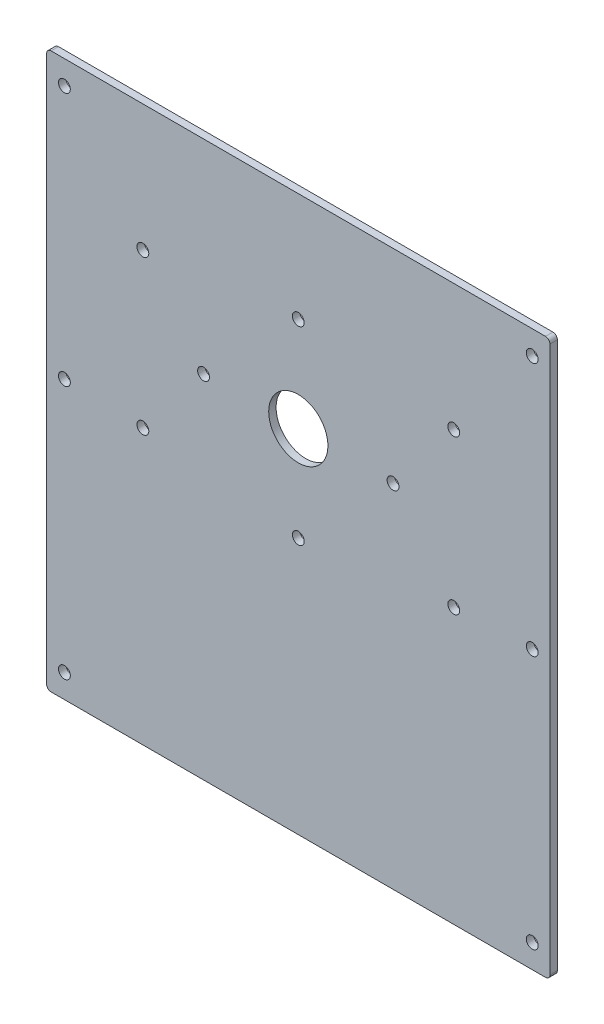
ISO-10303-21;
HEADER;
FILE_DESCRIPTION(('STEP AP214'),'2;1');
FILE_NAME('part.step','',(''),(''),'','','');
FILE_SCHEMA(('AUTOMOTIVE_DESIGN { 1 0 10303 214 1 1 1 1 }'));
ENDSEC;
DATA;
#1=APPLICATION_CONTEXT('core data for automotive mechanical design processes');
#2=APPLICATION_PROTOCOL_DEFINITION('international standard','automotive_design',2000,#1);
#3=PRODUCT_CONTEXT('',#1,'mechanical');
#4=PRODUCT('Part','Part','',(#3));
#5=PRODUCT_RELATED_PRODUCT_CATEGORY('part','',(#4));
#6=PRODUCT_DEFINITION_FORMATION('','',#4);
#7=PRODUCT_DEFINITION_CONTEXT('part definition',#1,'design');
#8=PRODUCT_DEFINITION('design','',#6,#7);
#9=PRODUCT_DEFINITION_SHAPE('','',#8);
#10=(LENGTH_UNIT() NAMED_UNIT(*) SI_UNIT(.MILLI.,.METRE.));
#11=(NAMED_UNIT(*) PLANE_ANGLE_UNIT() SI_UNIT($,.RADIAN.));
#12=(NAMED_UNIT(*) SI_UNIT($,.STERADIAN.) SOLID_ANGLE_UNIT());
#13=UNCERTAINTY_MEASURE_WITH_UNIT(LENGTH_MEASURE(1.E-05),#10,'distance_accuracy_value','');
#14=(GEOMETRIC_REPRESENTATION_CONTEXT(3) GLOBAL_UNCERTAINTY_ASSIGNED_CONTEXT((#13)) GLOBAL_UNIT_ASSIGNED_CONTEXT((#10,
#11,#12)) REPRESENTATION_CONTEXT('',''));
#15=CARTESIAN_POINT('',(0.,0.,0.));
#16=DIRECTION('',(0.,0.,1.));
#17=DIRECTION('',(1.,0.,0.));
#18=AXIS2_PLACEMENT_3D('',#15,#16,#17);
#19=CARTESIAN_POINT('',(-167.,184.5,0.));
#20=DIRECTION('',(0.,0.,1.));
#21=DIRECTION('',(1.,0.,0.));
#22=AXIS2_PLACEMENT_3D('',#19,#20,#21);
#23=CYLINDRICAL_SURFACE('',#22,3.);
#24=CARTESIAN_POINT('',(-167.,184.5,5.));
#25=DIRECTION('',(0.,0.,1.));
#26=DIRECTION('',(1.,0.,0.));
#27=AXIS2_PLACEMENT_3D('',#24,#25,#26);
#28=CIRCLE('',#27,3.);
#29=CARTESIAN_POINT('',(-167.,187.5,5.));
#30=VERTEX_POINT('',#29);
#31=CARTESIAN_POINT('',(-170.,184.5,5.));
#32=VERTEX_POINT('',#31);
#33=EDGE_CURVE('E130',#30,#32,#28,.T.);
#34=ORIENTED_EDGE('',*,*,#33,.F.);
#35=DIRECTION('',(0.,0.,1.));
#36=VECTOR('',#35,1.);
#37=CARTESIAN_POINT('',(-167.,187.5,0.));
#38=LINE('',#37,#36);
#39=CARTESIAN_POINT('',(-167.,187.5,0.));
#40=VERTEX_POINT('',#39);
#41=EDGE_CURVE('E11',#40,#30,#38,.T.);
#42=ORIENTED_EDGE('',*,*,#41,.F.);
#43=CARTESIAN_POINT('',(-167.,184.5,0.));
#44=DIRECTION('',(0.,0.,1.));
#45=DIRECTION('',(1.,0.,0.));
#46=AXIS2_PLACEMENT_3D('',#43,#44,#45);
#47=CIRCLE('',#46,3.);
#48=CARTESIAN_POINT('',(-170.,184.5,0.));
#49=VERTEX_POINT('',#48);
#50=EDGE_CURVE('E151',#40,#49,#47,.T.);
#51=ORIENTED_EDGE('',*,*,#50,.T.);
#52=DIRECTION('',(0.,0.,1.));
#53=VECTOR('',#52,1.);
#54=CARTESIAN_POINT('',(-170.,184.5,0.));
#55=LINE('',#54,#53);
#56=EDGE_CURVE('E36',#49,#32,#55,.T.);
#57=ORIENTED_EDGE('',*,*,#56,.T.);
#58=EDGE_LOOP('',(#34,#42,#51,#57));
#59=FACE_BOUND('',#58,.T.);
#60=ADVANCED_FACE('F33',(#59),#23,.T.);
#61=CARTESIAN_POINT('',(167.,187.5,0.));
#62=DIRECTION('',(0.,1.,0.));
#63=DIRECTION('',(-1.,0.,0.));
#64=AXIS2_PLACEMENT_3D('',#61,#62,#63);
#65=PLANE('',#64);
#66=DIRECTION('',(-1.,0.,0.));
#67=VECTOR('',#66,1.);
#68=CARTESIAN_POINT('',(167.,187.5,5.));
#69=LINE('',#68,#67);
#70=CARTESIAN_POINT('',(167.,187.5,5.));
#71=VERTEX_POINT('',#70);
#72=EDGE_CURVE('E149',#71,#30,#69,.T.);
#73=ORIENTED_EDGE('',*,*,#72,.F.);
#74=DIRECTION('',(0.,0.,1.));
#75=VECTOR('',#74,1.);
#76=CARTESIAN_POINT('',(167.,187.5,0.));
#77=LINE('',#76,#75);
#78=CARTESIAN_POINT('',(167.,187.5,0.));
#79=VERTEX_POINT('',#78);
#80=EDGE_CURVE('E42',#79,#71,#77,.T.);
#81=ORIENTED_EDGE('',*,*,#80,.F.);
#82=DIRECTION('',(-1.,0.,0.));
#83=VECTOR('',#82,1.);
#84=CARTESIAN_POINT('',(167.,187.5,0.));
#85=LINE('',#84,#83);
#86=EDGE_CURVE('E120',#79,#40,#85,.T.);
#87=ORIENTED_EDGE('',*,*,#86,.T.);
#88=ORIENTED_EDGE('',*,*,#41,.T.);
#89=EDGE_LOOP('',(#73,#81,#87,#88));
#90=FACE_BOUND('',#89,.T.);
#91=ADVANCED_FACE('F163',(#90),#65,.T.);
#92=CARTESIAN_POINT('',(167.,184.5,0.));
#93=DIRECTION('',(0.,0.,1.));
#94=DIRECTION('',(1.,0.,0.));
#95=AXIS2_PLACEMENT_3D('',#92,#93,#94);
#96=CYLINDRICAL_SURFACE('',#95,3.00000000000004);
#97=CARTESIAN_POINT('',(167.,184.5,5.));
#98=DIRECTION('',(0.,0.,1.));
#99=DIRECTION('',(1.,0.,0.));
#100=AXIS2_PLACEMENT_3D('',#97,#98,#99);
#101=CIRCLE('',#100,3.00000000000004);
#102=CARTESIAN_POINT('',(170.,184.5,5.));
#103=VERTEX_POINT('',#102);
#104=EDGE_CURVE('E107',#103,#71,#101,.T.);
#105=ORIENTED_EDGE('',*,*,#104,.F.);
#106=DIRECTION('',(0.,0.,1.));
#107=VECTOR('',#106,1.);
#108=CARTESIAN_POINT('',(170.,184.5,0.));
#109=LINE('',#108,#107);
#110=CARTESIAN_POINT('',(170.,184.5,0.));
#111=VERTEX_POINT('',#110);
#112=EDGE_CURVE('E102',#111,#103,#109,.T.);
#113=ORIENTED_EDGE('',*,*,#112,.F.);
#114=CARTESIAN_POINT('',(167.,184.5,0.));
#115=DIRECTION('',(0.,0.,1.));
#116=DIRECTION('',(1.,0.,0.));
#117=AXIS2_PLACEMENT_3D('',#114,#115,#116);
#118=CIRCLE('',#117,3.00000000000004);
#119=EDGE_CURVE('E105',#111,#79,#118,.T.);
#120=ORIENTED_EDGE('',*,*,#119,.T.);
#121=ORIENTED_EDGE('',*,*,#80,.T.);
#122=EDGE_LOOP('',(#105,#113,#120,#121));
#123=FACE_BOUND('',#122,.T.);
#124=ADVANCED_FACE('F104',(#123),#96,.T.);
#125=CARTESIAN_POINT('',(170.,-184.5,0.));
#126=DIRECTION('',(1.,0.,0.));
#127=DIRECTION('',(0.,0.,-1.));
#128=AXIS2_PLACEMENT_3D('',#125,#126,#127);
#129=PLANE('',#128);
#130=DIRECTION('',(0.,1.,0.));
#131=VECTOR('',#130,1.);
#132=CARTESIAN_POINT('',(170.,-184.5,5.));
#133=LINE('',#132,#131);
#134=CARTESIAN_POINT('',(170.,-184.5,5.));
#135=VERTEX_POINT('',#134);
#136=EDGE_CURVE('E146',#135,#103,#133,.T.);
#137=ORIENTED_EDGE('',*,*,#136,.F.);
#138=DIRECTION('',(0.,0.,1.));
#139=VECTOR('',#138,1.);
#140=CARTESIAN_POINT('',(170.,-184.5,0.));
#141=LINE('',#140,#139);
#142=CARTESIAN_POINT('',(170.,-184.5,0.));
#143=VERTEX_POINT('',#142);
#144=EDGE_CURVE('E112',#143,#135,#141,.T.);
#145=ORIENTED_EDGE('',*,*,#144,.F.);
#146=DIRECTION('',(0.,1.,0.));
#147=VECTOR('',#146,1.);
#148=CARTESIAN_POINT('',(170.,-184.5,0.));
#149=LINE('',#148,#147);
#150=EDGE_CURVE('E118',#143,#111,#149,.T.);
#151=ORIENTED_EDGE('',*,*,#150,.T.);
#152=ORIENTED_EDGE('',*,*,#112,.T.);
#153=EDGE_LOOP('',(#137,#145,#151,#152));
#154=FACE_BOUND('',#153,.T.);
#155=ADVANCED_FACE('F122',(#154),#129,.T.);
#156=CARTESIAN_POINT('',(167.,-184.5,0.));
#157=DIRECTION('',(0.,0.,1.));
#158=DIRECTION('',(1.,0.,0.));
#159=AXIS2_PLACEMENT_3D('',#156,#157,#158);
#160=CYLINDRICAL_SURFACE('',#159,3.00000000000002);
#161=CARTESIAN_POINT('',(167.,-184.5,5.));
#162=DIRECTION('',(0.,0.,1.));
#163=DIRECTION('',(1.,0.,0.));
#164=AXIS2_PLACEMENT_3D('',#161,#162,#163);
#165=CIRCLE('',#164,3.00000000000002);
#166=CARTESIAN_POINT('',(167.,-187.5,5.));
#167=VERTEX_POINT('',#166);
#168=EDGE_CURVE('E143',#167,#135,#165,.T.);
#169=ORIENTED_EDGE('',*,*,#168,.F.);
#170=DIRECTION('',(0.,0.,1.));
#171=VECTOR('',#170,1.);
#172=CARTESIAN_POINT('',(167.,-187.5,0.));
#173=LINE('',#172,#171);
#174=CARTESIAN_POINT('',(167.,-187.5,0.));
#175=VERTEX_POINT('',#174);
#176=EDGE_CURVE('E155',#175,#167,#173,.T.);
#177=ORIENTED_EDGE('',*,*,#176,.F.);
#178=CARTESIAN_POINT('',(167.,-184.5,0.));
#179=DIRECTION('',(0.,0.,1.));
#180=DIRECTION('',(1.,0.,0.));
#181=AXIS2_PLACEMENT_3D('',#178,#179,#180);
#182=CIRCLE('',#181,3.00000000000002);
#183=EDGE_CURVE('E123',#175,#143,#182,.T.);
#184=ORIENTED_EDGE('',*,*,#183,.T.);
#185=ORIENTED_EDGE('',*,*,#144,.T.);
#186=EDGE_LOOP('',(#169,#177,#184,#185));
#187=FACE_BOUND('',#186,.T.);
#188=ADVANCED_FACE('F176',(#187),#160,.T.);
#189=CARTESIAN_POINT('',(-167.,-187.5,0.));
#190=DIRECTION('',(0.,-1.,0.));
#191=DIRECTION('',(0.,0.,-1.));
#192=AXIS2_PLACEMENT_3D('',#189,#190,#191);
#193=PLANE('',#192);
#194=DIRECTION('',(1.,0.,0.));
#195=VECTOR('',#194,1.);
#196=CARTESIAN_POINT('',(-167.,-187.5,5.));
#197=LINE('',#196,#195);
#198=CARTESIAN_POINT('',(-167.,-187.5,5.));
#199=VERTEX_POINT('',#198);
#200=EDGE_CURVE('E140',#199,#167,#197,.T.);
#201=ORIENTED_EDGE('',*,*,#200,.F.);
#202=DIRECTION('',(0.,0.,1.));
#203=VECTOR('',#202,1.);
#204=CARTESIAN_POINT('',(-167.,-187.5,0.));
#205=LINE('',#204,#203);
#206=CARTESIAN_POINT('',(-167.,-187.5,0.));
#207=VERTEX_POINT('',#206);
#208=EDGE_CURVE('E157',#207,#199,#205,.T.);
#209=ORIENTED_EDGE('',*,*,#208,.F.);
#210=DIRECTION('',(1.,0.,0.));
#211=VECTOR('',#210,1.);
#212=CARTESIAN_POINT('',(-167.,-187.5,0.));
#213=LINE('',#212,#211);
#214=EDGE_CURVE('E125',#207,#175,#213,.T.);
#215=ORIENTED_EDGE('',*,*,#214,.T.);
#216=ORIENTED_EDGE('',*,*,#176,.T.);
#217=EDGE_LOOP('',(#201,#209,#215,#216));
#218=FACE_BOUND('',#217,.T.);
#219=ADVANCED_FACE('F179',(#218),#193,.T.);
#220=CARTESIAN_POINT('',(-167.,-184.5,0.));
#221=DIRECTION('',(0.,0.,1.));
#222=DIRECTION('',(1.,0.,0.));
#223=AXIS2_PLACEMENT_3D('',#220,#221,#222);
#224=CYLINDRICAL_SURFACE('',#223,2.99999999999998);
#225=CARTESIAN_POINT('',(-167.,-184.5,5.));
#226=DIRECTION('',(0.,0.,1.));
#227=DIRECTION('',(1.,0.,0.));
#228=AXIS2_PLACEMENT_3D('',#225,#226,#227);
#229=CIRCLE('',#228,2.99999999999998);
#230=CARTESIAN_POINT('',(-170.,-184.5,5.));
#231=VERTEX_POINT('',#230);
#232=EDGE_CURVE('E137',#231,#199,#229,.T.);
#233=ORIENTED_EDGE('',*,*,#232,.F.);
#234=DIRECTION('',(0.,0.,1.));
#235=VECTOR('',#234,1.);
#236=CARTESIAN_POINT('',(-170.,-184.5,0.));
#237=LINE('',#236,#235);
#238=CARTESIAN_POINT('',(-170.,-184.5,0.));
#239=VERTEX_POINT('',#238);
#240=EDGE_CURVE('E158',#239,#231,#237,.T.);
#241=ORIENTED_EDGE('',*,*,#240,.F.);
#242=CARTESIAN_POINT('',(-167.,-184.5,0.));
#243=DIRECTION('',(0.,0.,1.));
#244=DIRECTION('',(1.,0.,0.));
#245=AXIS2_PLACEMENT_3D('',#242,#243,#244);
#246=CIRCLE('',#245,2.99999999999998);
#247=EDGE_CURVE('E355',#239,#207,#246,.T.);
#248=ORIENTED_EDGE('',*,*,#247,.T.);
#249=ORIENTED_EDGE('',*,*,#208,.T.);
#250=EDGE_LOOP('',(#233,#241,#248,#249));
#251=FACE_BOUND('',#250,.T.);
#252=ADVANCED_FACE('F183',(#251),#224,.T.);
#253=CARTESIAN_POINT('',(-170.,184.5,0.));
#254=DIRECTION('',(-1.,0.,0.));
#255=DIRECTION('',(0.,-1.,0.));
#256=AXIS2_PLACEMENT_3D('',#253,#254,#255);
#257=PLANE('',#256);
#258=DIRECTION('',(0.,-1.,0.));
#259=VECTOR('',#258,1.);
#260=CARTESIAN_POINT('',(-170.,184.5,5.));
#261=LINE('',#260,#259);
#262=EDGE_CURVE('E133',#32,#231,#261,.T.);
#263=ORIENTED_EDGE('',*,*,#262,.F.);
#264=ORIENTED_EDGE('',*,*,#56,.F.);
#265=DIRECTION('',(0.,-1.,0.));
#266=VECTOR('',#265,1.);
#267=CARTESIAN_POINT('',(-170.,184.5,0.));
#268=LINE('',#267,#266);
#269=EDGE_CURVE('E353',#49,#239,#268,.T.);
#270=ORIENTED_EDGE('',*,*,#269,.T.);
#271=ORIENTED_EDGE('',*,*,#240,.T.);
#272=EDGE_LOOP('',(#263,#264,#270,#271));
#273=FACE_BOUND('',#272,.T.);
#274=ADVANCED_FACE('F160',(#273),#257,.T.);
#275=CARTESIAN_POINT('',(-167.,184.5,0.));
#276=DIRECTION('',(0.,0.,1.));
#277=DIRECTION('',(1.,0.,0.));
#278=AXIS2_PLACEMENT_3D('',#275,#276,#277);
#279=PLANE('',#278);
#280=CARTESIAN_POINT('',(105.,-1.99999999999998,0.));
#281=DIRECTION('',(0.,0.,1.));
#282=DIRECTION('',(-1.,0.,0.));
#283=AXIS2_PLACEMENT_3D('',#280,#281,#282);
#284=CIRCLE('',#283,4.00000000000001);
#285=CARTESIAN_POINT('',(101.,-1.99999999999998,0.));
#286=VERTEX_POINT('',#285);
#287=EDGE_CURVE('E262',#286,#286,#284,.T.);
#288=ORIENTED_EDGE('',*,*,#287,.T.);
#289=EDGE_LOOP('',(#288));
#290=FACE_BOUND('',#289,.T.);
#291=CARTESIAN_POINT('',(105.,102.,0.));
#292=DIRECTION('',(0.,0.,1.));
#293=DIRECTION('',(-1.,0.,0.));
#294=AXIS2_PLACEMENT_3D('',#291,#292,#293);
#295=CIRCLE('',#294,4.00000000000001);
#296=CARTESIAN_POINT('',(101.,102.,0.));
#297=VERTEX_POINT('',#296);
#298=EDGE_CURVE('E270',#297,#297,#295,.T.);
#299=ORIENTED_EDGE('',*,*,#298,.T.);
#300=EDGE_LOOP('',(#299));
#301=FACE_BOUND('',#300,.T.);
#302=CARTESIAN_POINT('',(-105.,-1.99999999999998,0.));
#303=DIRECTION('',(0.,0.,1.));
#304=DIRECTION('',(-1.,0.,0.));
#305=AXIS2_PLACEMENT_3D('',#302,#303,#304);
#306=CIRCLE('',#305,4.00000000000001);
#307=CARTESIAN_POINT('',(-109.,-1.99999999999998,0.));
#308=VERTEX_POINT('',#307);
#309=EDGE_CURVE('E276',#308,#308,#306,.T.);
#310=ORIENTED_EDGE('',*,*,#309,.T.);
#311=EDGE_LOOP('',(#310));
#312=FACE_BOUND('',#311,.T.);
#313=CARTESIAN_POINT('',(-105.,102.,0.));
#314=DIRECTION('',(0.,0.,1.));
#315=DIRECTION('',(-1.,0.,0.));
#316=AXIS2_PLACEMENT_3D('',#313,#314,#315);
#317=CIRCLE('',#316,4.00000000000001);
#318=CARTESIAN_POINT('',(-109.,102.,0.));
#319=VERTEX_POINT('',#318);
#320=EDGE_CURVE('E282',#319,#319,#317,.T.);
#321=ORIENTED_EDGE('',*,*,#320,.T.);
#322=EDGE_LOOP('',(#321));
#323=FACE_BOUND('',#322,.T.);
#324=CARTESIAN_POINT('',(158.,-171.5,0.));
#325=DIRECTION('',(0.,0.,1.));
#326=DIRECTION('',(-1.,0.,0.));
#327=AXIS2_PLACEMENT_3D('',#324,#325,#326);
#328=CIRCLE('',#327,3.99999999999999);
#329=CARTESIAN_POINT('',(154.,-171.5,0.));
#330=VERTEX_POINT('',#329);
#331=EDGE_CURVE('E288',#330,#330,#328,.T.);
#332=ORIENTED_EDGE('',*,*,#331,.T.);
#333=EDGE_LOOP('',(#332));
#334=FACE_BOUND('',#333,.T.);
#335=CARTESIAN_POINT('',(-158.,-171.5,0.));
#336=DIRECTION('',(0.,0.,1.));
#337=DIRECTION('',(-1.,0.,0.));
#338=AXIS2_PLACEMENT_3D('',#335,#336,#337);
#339=CIRCLE('',#338,3.99999999999999);
#340=CARTESIAN_POINT('',(-162.,-171.5,0.));
#341=VERTEX_POINT('',#340);
#342=EDGE_CURVE('E294',#341,#341,#339,.T.);
#343=ORIENTED_EDGE('',*,*,#342,.T.);
#344=EDGE_LOOP('',(#343));
#345=FACE_BOUND('',#344,.T.);
#346=CARTESIAN_POINT('',(-158.,171.5,0.));
#347=DIRECTION('',(0.,0.,1.));
#348=DIRECTION('',(-1.,0.,0.));
#349=AXIS2_PLACEMENT_3D('',#346,#347,#348);
#350=CIRCLE('',#349,3.99999999999999);
#351=CARTESIAN_POINT('',(-162.,171.5,0.));
#352=VERTEX_POINT('',#351);
#353=EDGE_CURVE('E300',#352,#352,#350,.T.);
#354=ORIENTED_EDGE('',*,*,#353,.T.);
#355=EDGE_LOOP('',(#354));
#356=FACE_BOUND('',#355,.T.);
#357=CARTESIAN_POINT('',(158.,171.5,0.));
#358=DIRECTION('',(0.,0.,1.));
#359=DIRECTION('',(-1.,0.,0.));
#360=AXIS2_PLACEMENT_3D('',#357,#358,#359);
#361=CIRCLE('',#360,3.99999999999999);
#362=CARTESIAN_POINT('',(154.,171.5,0.));
#363=VERTEX_POINT('',#362);
#364=EDGE_CURVE('E306',#363,#363,#361,.T.);
#365=ORIENTED_EDGE('',*,*,#364,.T.);
#366=EDGE_LOOP('',(#365));
#367=FACE_BOUND('',#366,.T.);
#368=CARTESIAN_POINT('',(-158.,0.,0.));
#369=DIRECTION('',(0.,0.,1.));
#370=DIRECTION('',(-1.,0.,0.));
#371=AXIS2_PLACEMENT_3D('',#368,#369,#370);
#372=CIRCLE('',#371,3.99999999999999);
#373=CARTESIAN_POINT('',(-162.,0.,0.));
#374=VERTEX_POINT('',#373);
#375=EDGE_CURVE('E312',#374,#374,#372,.T.);
#376=ORIENTED_EDGE('',*,*,#375,.T.);
#377=EDGE_LOOP('',(#376));
#378=FACE_BOUND('',#377,.T.);
#379=CARTESIAN_POINT('',(158.,0.,0.));
#380=DIRECTION('',(0.,0.,1.));
#381=DIRECTION('',(-1.,0.,0.));
#382=AXIS2_PLACEMENT_3D('',#379,#380,#381);
#383=CIRCLE('',#382,3.99999999999999);
#384=CARTESIAN_POINT('',(154.,0.,0.));
#385=VERTEX_POINT('',#384);
#386=EDGE_CURVE('E318',#385,#385,#383,.T.);
#387=ORIENTED_EDGE('',*,*,#386,.T.);
#388=EDGE_LOOP('',(#387));
#389=FACE_BOUND('',#388,.T.);
#390=CARTESIAN_POINT('',(0.,-14.,0.));
#391=DIRECTION('',(0.,0.,1.));
#392=DIRECTION('',(-1.,0.,0.));
#393=AXIS2_PLACEMENT_3D('',#390,#391,#392);
#394=CIRCLE('',#393,4.);
#395=CARTESIAN_POINT('',(-3.99999999999999,-14.,0.));
#396=VERTEX_POINT('',#395);
#397=EDGE_CURVE('E324',#396,#396,#394,.T.);
#398=ORIENTED_EDGE('',*,*,#397,.T.);
#399=EDGE_LOOP('',(#398));
#400=FACE_BOUND('',#399,.T.);
#401=CARTESIAN_POINT('',(64.,50.,0.));
#402=DIRECTION('',(0.,0.,1.));
#403=DIRECTION('',(-1.,0.,0.));
#404=AXIS2_PLACEMENT_3D('',#401,#402,#403);
#405=CIRCLE('',#404,4.00000000000001);
#406=CARTESIAN_POINT('',(60.,50.,0.));
#407=VERTEX_POINT('',#406);
#408=EDGE_CURVE('E330',#407,#407,#405,.T.);
#409=ORIENTED_EDGE('',*,*,#408,.T.);
#410=EDGE_LOOP('',(#409));
#411=FACE_BOUND('',#410,.T.);
#412=CARTESIAN_POINT('',(0.,114.,0.));
#413=DIRECTION('',(0.,0.,1.));
#414=DIRECTION('',(-1.,0.,0.));
#415=AXIS2_PLACEMENT_3D('',#412,#413,#414);
#416=CIRCLE('',#415,4.);
#417=CARTESIAN_POINT('',(-4.,114.,0.));
#418=VERTEX_POINT('',#417);
#419=EDGE_CURVE('E336',#418,#418,#416,.T.);
#420=ORIENTED_EDGE('',*,*,#419,.T.);
#421=EDGE_LOOP('',(#420));
#422=FACE_BOUND('',#421,.T.);
#423=CARTESIAN_POINT('',(-64.,50.,0.));
#424=DIRECTION('',(0.,0.,1.));
#425=DIRECTION('',(-1.,0.,0.));
#426=AXIS2_PLACEMENT_3D('',#423,#424,#425);
#427=CIRCLE('',#426,4.00000000000001);
#428=CARTESIAN_POINT('',(-68.,50.,0.));
#429=VERTEX_POINT('',#428);
#430=EDGE_CURVE('E342',#429,#429,#427,.T.);
#431=ORIENTED_EDGE('',*,*,#430,.T.);
#432=EDGE_LOOP('',(#431));
#433=FACE_BOUND('',#432,.T.);
#434=CARTESIAN_POINT('',(0.,50.,0.));
#435=DIRECTION('',(0.,0.,1.));
#436=DIRECTION('',(-1.,0.,0.));
#437=AXIS2_PLACEMENT_3D('',#434,#435,#436);
#438=CIRCLE('',#437,20.);
#439=CARTESIAN_POINT('',(-20.,50.,0.));
#440=VERTEX_POINT('',#439);
#441=EDGE_CURVE('E134',#440,#440,#438,.T.);
#442=ORIENTED_EDGE('',*,*,#441,.T.);
#443=EDGE_LOOP('',(#442));
#444=FACE_BOUND('',#443,.T.);
#445=ORIENTED_EDGE('',*,*,#50,.F.);
#446=ORIENTED_EDGE('',*,*,#86,.F.);
#447=ORIENTED_EDGE('',*,*,#119,.F.);
#448=ORIENTED_EDGE('',*,*,#150,.F.);
#449=ORIENTED_EDGE('',*,*,#183,.F.);
#450=ORIENTED_EDGE('',*,*,#214,.F.);
#451=ORIENTED_EDGE('',*,*,#247,.F.);
#452=ORIENTED_EDGE('',*,*,#269,.F.);
#453=EDGE_LOOP('',(#445,#446,#447,#448,#449,#450,#451,#452));
#454=FACE_BOUND('',#453,.T.);
#455=ADVANCED_FACE('F116',(#290,#301,#312,#323,#334,#345,#356,#367,#378,#389,#400,#411,#422,
#433,#444,#454),#279,.F.);
#456=CARTESIAN_POINT('',(-167.,184.5,5.));
#457=DIRECTION('',(0.,0.,1.));
#458=DIRECTION('',(1.,0.,0.));
#459=AXIS2_PLACEMENT_3D('',#456,#457,#458);
#460=PLANE('',#459);
#461=CARTESIAN_POINT('',(105.,-1.99999999999998,5.));
#462=DIRECTION('',(0.,0.,1.));
#463=DIRECTION('',(-1.,0.,0.));
#464=AXIS2_PLACEMENT_3D('',#461,#462,#463);
#465=CIRCLE('',#464,4.00000000000001);
#466=CARTESIAN_POINT('',(101.,-1.99999999999998,5.));
#467=VERTEX_POINT('',#466);
#468=EDGE_CURVE('E265',#467,#467,#465,.T.);
#469=ORIENTED_EDGE('',*,*,#468,.F.);
#470=EDGE_LOOP('',(#469));
#471=FACE_BOUND('',#470,.T.);
#472=CARTESIAN_POINT('',(105.,102.,5.));
#473=DIRECTION('',(0.,0.,1.));
#474=DIRECTION('',(-1.,0.,0.));
#475=AXIS2_PLACEMENT_3D('',#472,#473,#474);
#476=CIRCLE('',#475,4.00000000000001);
#477=CARTESIAN_POINT('',(101.,102.,5.));
#478=VERTEX_POINT('',#477);
#479=EDGE_CURVE('E267',#478,#478,#476,.T.);
#480=ORIENTED_EDGE('',*,*,#479,.F.);
#481=EDGE_LOOP('',(#480));
#482=FACE_BOUND('',#481,.T.);
#483=CARTESIAN_POINT('',(-105.,-1.99999999999998,5.));
#484=DIRECTION('',(0.,0.,1.));
#485=DIRECTION('',(-1.,0.,0.));
#486=AXIS2_PLACEMENT_3D('',#483,#484,#485);
#487=CIRCLE('',#486,4.00000000000001);
#488=CARTESIAN_POINT('',(-109.,-1.99999999999998,5.));
#489=VERTEX_POINT('',#488);
#490=EDGE_CURVE('E273',#489,#489,#487,.T.);
#491=ORIENTED_EDGE('',*,*,#490,.F.);
#492=EDGE_LOOP('',(#491));
#493=FACE_BOUND('',#492,.T.);
#494=CARTESIAN_POINT('',(-105.,102.,5.));
#495=DIRECTION('',(0.,0.,1.));
#496=DIRECTION('',(-1.,0.,0.));
#497=AXIS2_PLACEMENT_3D('',#494,#495,#496);
#498=CIRCLE('',#497,4.00000000000001);
#499=CARTESIAN_POINT('',(-109.,102.,5.));
#500=VERTEX_POINT('',#499);
#501=EDGE_CURVE('E279',#500,#500,#498,.T.);
#502=ORIENTED_EDGE('',*,*,#501,.F.);
#503=EDGE_LOOP('',(#502));
#504=FACE_BOUND('',#503,.T.);
#505=CARTESIAN_POINT('',(158.,-171.5,5.));
#506=DIRECTION('',(0.,0.,1.));
#507=DIRECTION('',(-1.,0.,0.));
#508=AXIS2_PLACEMENT_3D('',#505,#506,#507);
#509=CIRCLE('',#508,3.99999999999999);
#510=CARTESIAN_POINT('',(154.,-171.5,5.));
#511=VERTEX_POINT('',#510);
#512=EDGE_CURVE('E285',#511,#511,#509,.T.);
#513=ORIENTED_EDGE('',*,*,#512,.F.);
#514=EDGE_LOOP('',(#513));
#515=FACE_BOUND('',#514,.T.);
#516=CARTESIAN_POINT('',(-158.,-171.5,5.));
#517=DIRECTION('',(0.,0.,1.));
#518=DIRECTION('',(-1.,0.,0.));
#519=AXIS2_PLACEMENT_3D('',#516,#517,#518);
#520=CIRCLE('',#519,3.99999999999999);
#521=CARTESIAN_POINT('',(-162.,-171.5,5.));
#522=VERTEX_POINT('',#521);
#523=EDGE_CURVE('E291',#522,#522,#520,.T.);
#524=ORIENTED_EDGE('',*,*,#523,.F.);
#525=EDGE_LOOP('',(#524));
#526=FACE_BOUND('',#525,.T.);
#527=CARTESIAN_POINT('',(-158.,171.5,5.));
#528=DIRECTION('',(0.,0.,1.));
#529=DIRECTION('',(-1.,0.,0.));
#530=AXIS2_PLACEMENT_3D('',#527,#528,#529);
#531=CIRCLE('',#530,3.99999999999999);
#532=CARTESIAN_POINT('',(-162.,171.5,5.));
#533=VERTEX_POINT('',#532);
#534=EDGE_CURVE('E297',#533,#533,#531,.T.);
#535=ORIENTED_EDGE('',*,*,#534,.F.);
#536=EDGE_LOOP('',(#535));
#537=FACE_BOUND('',#536,.T.);
#538=CARTESIAN_POINT('',(158.,171.5,5.));
#539=DIRECTION('',(0.,0.,1.));
#540=DIRECTION('',(-1.,0.,0.));
#541=AXIS2_PLACEMENT_3D('',#538,#539,#540);
#542=CIRCLE('',#541,3.99999999999999);
#543=CARTESIAN_POINT('',(154.,171.5,5.));
#544=VERTEX_POINT('',#543);
#545=EDGE_CURVE('E303',#544,#544,#542,.T.);
#546=ORIENTED_EDGE('',*,*,#545,.F.);
#547=EDGE_LOOP('',(#546));
#548=FACE_BOUND('',#547,.T.);
#549=CARTESIAN_POINT('',(-158.,0.,5.));
#550=DIRECTION('',(0.,0.,1.));
#551=DIRECTION('',(-1.,0.,0.));
#552=AXIS2_PLACEMENT_3D('',#549,#550,#551);
#553=CIRCLE('',#552,3.99999999999999);
#554=CARTESIAN_POINT('',(-162.,0.,5.));
#555=VERTEX_POINT('',#554);
#556=EDGE_CURVE('E309',#555,#555,#553,.T.);
#557=ORIENTED_EDGE('',*,*,#556,.F.);
#558=EDGE_LOOP('',(#557));
#559=FACE_BOUND('',#558,.T.);
#560=CARTESIAN_POINT('',(158.,0.,5.));
#561=DIRECTION('',(0.,0.,1.));
#562=DIRECTION('',(-1.,0.,0.));
#563=AXIS2_PLACEMENT_3D('',#560,#561,#562);
#564=CIRCLE('',#563,3.99999999999999);
#565=CARTESIAN_POINT('',(154.,0.,5.));
#566=VERTEX_POINT('',#565);
#567=EDGE_CURVE('E315',#566,#566,#564,.T.);
#568=ORIENTED_EDGE('',*,*,#567,.F.);
#569=EDGE_LOOP('',(#568));
#570=FACE_BOUND('',#569,.T.);
#571=CARTESIAN_POINT('',(0.,-14.,5.));
#572=DIRECTION('',(0.,0.,1.));
#573=DIRECTION('',(-1.,0.,0.));
#574=AXIS2_PLACEMENT_3D('',#571,#572,#573);
#575=CIRCLE('',#574,4.);
#576=CARTESIAN_POINT('',(-3.99999999999999,-14.,5.));
#577=VERTEX_POINT('',#576);
#578=EDGE_CURVE('E321',#577,#577,#575,.T.);
#579=ORIENTED_EDGE('',*,*,#578,.F.);
#580=EDGE_LOOP('',(#579));
#581=FACE_BOUND('',#580,.T.);
#582=CARTESIAN_POINT('',(64.,50.,5.));
#583=DIRECTION('',(0.,0.,1.));
#584=DIRECTION('',(-1.,0.,0.));
#585=AXIS2_PLACEMENT_3D('',#582,#583,#584);
#586=CIRCLE('',#585,4.00000000000001);
#587=CARTESIAN_POINT('',(60.,50.,5.));
#588=VERTEX_POINT('',#587);
#589=EDGE_CURVE('E327',#588,#588,#586,.T.);
#590=ORIENTED_EDGE('',*,*,#589,.F.);
#591=EDGE_LOOP('',(#590));
#592=FACE_BOUND('',#591,.T.);
#593=CARTESIAN_POINT('',(0.,114.,5.));
#594=DIRECTION('',(0.,0.,1.));
#595=DIRECTION('',(-1.,0.,0.));
#596=AXIS2_PLACEMENT_3D('',#593,#594,#595);
#597=CIRCLE('',#596,4.);
#598=CARTESIAN_POINT('',(-4.,114.,5.));
#599=VERTEX_POINT('',#598);
#600=EDGE_CURVE('E333',#599,#599,#597,.T.);
#601=ORIENTED_EDGE('',*,*,#600,.F.);
#602=EDGE_LOOP('',(#601));
#603=FACE_BOUND('',#602,.T.);
#604=CARTESIAN_POINT('',(-64.,50.,5.));
#605=DIRECTION('',(0.,0.,1.));
#606=DIRECTION('',(-1.,0.,0.));
#607=AXIS2_PLACEMENT_3D('',#604,#605,#606);
#608=CIRCLE('',#607,4.00000000000001);
#609=CARTESIAN_POINT('',(-68.,50.,5.));
#610=VERTEX_POINT('',#609);
#611=EDGE_CURVE('E339',#610,#610,#608,.T.);
#612=ORIENTED_EDGE('',*,*,#611,.F.);
#613=EDGE_LOOP('',(#612));
#614=FACE_BOUND('',#613,.T.);
#615=CARTESIAN_POINT('',(0.,50.,5.));
#616=DIRECTION('',(0.,0.,1.));
#617=DIRECTION('',(-1.,0.,0.));
#618=AXIS2_PLACEMENT_3D('',#615,#616,#617);
#619=CIRCLE('',#618,20.);
#620=CARTESIAN_POINT('',(-20.,50.,5.));
#621=VERTEX_POINT('',#620);
#622=EDGE_CURVE('E345',#621,#621,#619,.T.);
#623=ORIENTED_EDGE('',*,*,#622,.F.);
#624=EDGE_LOOP('',(#623));
#625=FACE_BOUND('',#624,.T.);
#626=ORIENTED_EDGE('',*,*,#33,.T.);
#627=ORIENTED_EDGE('',*,*,#262,.T.);
#628=ORIENTED_EDGE('',*,*,#232,.T.);
#629=ORIENTED_EDGE('',*,*,#200,.T.);
#630=ORIENTED_EDGE('',*,*,#168,.T.);
#631=ORIENTED_EDGE('',*,*,#136,.T.);
#632=ORIENTED_EDGE('',*,*,#104,.T.);
#633=ORIENTED_EDGE('',*,*,#72,.T.);
#634=EDGE_LOOP('',(#626,#627,#628,#629,#630,#631,#632,#633));
#635=FACE_BOUND('',#634,.T.);
#636=ADVANCED_FACE('F162',(#471,#482,#493,#504,#515,#526,#537,#548,#559,#570,#581,#592,#603,
#614,#625,#635),#460,.T.);
#637=CARTESIAN_POINT('',(0.,50.,0.));
#638=DIRECTION('',(0.,0.,1.));
#639=DIRECTION('',(1.,0.,0.));
#640=AXIS2_PLACEMENT_3D('',#637,#638,#639);
#641=CYLINDRICAL_SURFACE('',#640,20.);
#642=ORIENTED_EDGE('',*,*,#441,.F.);
#643=EDGE_LOOP('',(#642));
#644=FACE_BOUND('',#643,.T.);
#645=ORIENTED_EDGE('',*,*,#622,.T.);
#646=EDGE_LOOP('',(#645));
#647=FACE_BOUND('',#646,.T.);
#648=ADVANCED_FACE('F195',(#644,#647),#641,.F.);
#649=CARTESIAN_POINT('',(-64.,50.,0.));
#650=DIRECTION('',(0.,0.,1.));
#651=DIRECTION('',(1.,0.,0.));
#652=AXIS2_PLACEMENT_3D('',#649,#650,#651);
#653=CYLINDRICAL_SURFACE('',#652,4.00000000000001);
#654=ORIENTED_EDGE('',*,*,#430,.F.);
#655=EDGE_LOOP('',(#654));
#656=FACE_BOUND('',#655,.T.);
#657=ORIENTED_EDGE('',*,*,#611,.T.);
#658=EDGE_LOOP('',(#657));
#659=FACE_BOUND('',#658,.T.);
#660=ADVANCED_FACE('F202',(#656,#659),#653,.F.);
#661=CARTESIAN_POINT('',(0.,114.,0.));
#662=DIRECTION('',(0.,0.,1.));
#663=DIRECTION('',(1.,0.,0.));
#664=AXIS2_PLACEMENT_3D('',#661,#662,#663);
#665=CYLINDRICAL_SURFACE('',#664,4.);
#666=ORIENTED_EDGE('',*,*,#419,.F.);
#667=EDGE_LOOP('',(#666));
#668=FACE_BOUND('',#667,.T.);
#669=ORIENTED_EDGE('',*,*,#600,.T.);
#670=EDGE_LOOP('',(#669));
#671=FACE_BOUND('',#670,.T.);
#672=ADVANCED_FACE('F206',(#668,#671),#665,.F.);
#673=CARTESIAN_POINT('',(64.,50.,0.));
#674=DIRECTION('',(0.,0.,1.));
#675=DIRECTION('',(1.,0.,0.));
#676=AXIS2_PLACEMENT_3D('',#673,#674,#675);
#677=CYLINDRICAL_SURFACE('',#676,4.00000000000001);
#678=ORIENTED_EDGE('',*,*,#408,.F.);
#679=EDGE_LOOP('',(#678));
#680=FACE_BOUND('',#679,.T.);
#681=ORIENTED_EDGE('',*,*,#589,.T.);
#682=EDGE_LOOP('',(#681));
#683=FACE_BOUND('',#682,.T.);
#684=ADVANCED_FACE('F210',(#680,#683),#677,.F.);
#685=CARTESIAN_POINT('',(0.,-14.,0.));
#686=DIRECTION('',(0.,0.,1.));
#687=DIRECTION('',(1.,0.,0.));
#688=AXIS2_PLACEMENT_3D('',#685,#686,#687);
#689=CYLINDRICAL_SURFACE('',#688,4.);
#690=ORIENTED_EDGE('',*,*,#397,.F.);
#691=EDGE_LOOP('',(#690));
#692=FACE_BOUND('',#691,.T.);
#693=ORIENTED_EDGE('',*,*,#578,.T.);
#694=EDGE_LOOP('',(#693));
#695=FACE_BOUND('',#694,.T.);
#696=ADVANCED_FACE('F214',(#692,#695),#689,.F.);
#697=CARTESIAN_POINT('',(158.,0.,0.));
#698=DIRECTION('',(0.,0.,1.));
#699=DIRECTION('',(1.,0.,0.));
#700=AXIS2_PLACEMENT_3D('',#697,#698,#699);
#701=CYLINDRICAL_SURFACE('',#700,3.99999999999999);
#702=ORIENTED_EDGE('',*,*,#386,.F.);
#703=EDGE_LOOP('',(#702));
#704=FACE_BOUND('',#703,.T.);
#705=ORIENTED_EDGE('',*,*,#567,.T.);
#706=EDGE_LOOP('',(#705));
#707=FACE_BOUND('',#706,.T.);
#708=ADVANCED_FACE('F218',(#704,#707),#701,.F.);
#709=CARTESIAN_POINT('',(-158.,0.,0.));
#710=DIRECTION('',(0.,0.,1.));
#711=DIRECTION('',(1.,0.,0.));
#712=AXIS2_PLACEMENT_3D('',#709,#710,#711);
#713=CYLINDRICAL_SURFACE('',#712,3.99999999999999);
#714=ORIENTED_EDGE('',*,*,#375,.F.);
#715=EDGE_LOOP('',(#714));
#716=FACE_BOUND('',#715,.T.);
#717=ORIENTED_EDGE('',*,*,#556,.T.);
#718=EDGE_LOOP('',(#717));
#719=FACE_BOUND('',#718,.T.);
#720=ADVANCED_FACE('F222',(#716,#719),#713,.F.);
#721=CARTESIAN_POINT('',(158.,171.5,0.));
#722=DIRECTION('',(0.,0.,1.));
#723=DIRECTION('',(1.,0.,0.));
#724=AXIS2_PLACEMENT_3D('',#721,#722,#723);
#725=CYLINDRICAL_SURFACE('',#724,3.99999999999999);
#726=ORIENTED_EDGE('',*,*,#364,.F.);
#727=EDGE_LOOP('',(#726));
#728=FACE_BOUND('',#727,.T.);
#729=ORIENTED_EDGE('',*,*,#545,.T.);
#730=EDGE_LOOP('',(#729));
#731=FACE_BOUND('',#730,.T.);
#732=ADVANCED_FACE('F226',(#728,#731),#725,.F.);
#733=CARTESIAN_POINT('',(-158.,171.5,0.));
#734=DIRECTION('',(0.,0.,1.));
#735=DIRECTION('',(1.,0.,0.));
#736=AXIS2_PLACEMENT_3D('',#733,#734,#735);
#737=CYLINDRICAL_SURFACE('',#736,3.99999999999999);
#738=ORIENTED_EDGE('',*,*,#353,.F.);
#739=EDGE_LOOP('',(#738));
#740=FACE_BOUND('',#739,.T.);
#741=ORIENTED_EDGE('',*,*,#534,.T.);
#742=EDGE_LOOP('',(#741));
#743=FACE_BOUND('',#742,.T.);
#744=ADVANCED_FACE('F230',(#740,#743),#737,.F.);
#745=CARTESIAN_POINT('',(-158.,-171.5,0.));
#746=DIRECTION('',(0.,0.,1.));
#747=DIRECTION('',(1.,0.,0.));
#748=AXIS2_PLACEMENT_3D('',#745,#746,#747);
#749=CYLINDRICAL_SURFACE('',#748,3.99999999999999);
#750=ORIENTED_EDGE('',*,*,#342,.F.);
#751=EDGE_LOOP('',(#750));
#752=FACE_BOUND('',#751,.T.);
#753=ORIENTED_EDGE('',*,*,#523,.T.);
#754=EDGE_LOOP('',(#753));
#755=FACE_BOUND('',#754,.T.);
#756=ADVANCED_FACE('F234',(#752,#755),#749,.F.);
#757=CARTESIAN_POINT('',(158.,-171.5,0.));
#758=DIRECTION('',(0.,0.,1.));
#759=DIRECTION('',(1.,0.,0.));
#760=AXIS2_PLACEMENT_3D('',#757,#758,#759);
#761=CYLINDRICAL_SURFACE('',#760,3.99999999999999);
#762=ORIENTED_EDGE('',*,*,#331,.F.);
#763=EDGE_LOOP('',(#762));
#764=FACE_BOUND('',#763,.T.);
#765=ORIENTED_EDGE('',*,*,#512,.T.);
#766=EDGE_LOOP('',(#765));
#767=FACE_BOUND('',#766,.T.);
#768=ADVANCED_FACE('F238',(#764,#767),#761,.F.);
#769=CARTESIAN_POINT('',(-105.,102.,0.));
#770=DIRECTION('',(0.,0.,1.));
#771=DIRECTION('',(1.,0.,0.));
#772=AXIS2_PLACEMENT_3D('',#769,#770,#771);
#773=CYLINDRICAL_SURFACE('',#772,4.00000000000001);
#774=ORIENTED_EDGE('',*,*,#320,.F.);
#775=EDGE_LOOP('',(#774));
#776=FACE_BOUND('',#775,.T.);
#777=ORIENTED_EDGE('',*,*,#501,.T.);
#778=EDGE_LOOP('',(#777));
#779=FACE_BOUND('',#778,.T.);
#780=ADVANCED_FACE('F242',(#776,#779),#773,.F.);
#781=CARTESIAN_POINT('',(-105.,-1.99999999999998,0.));
#782=DIRECTION('',(0.,0.,1.));
#783=DIRECTION('',(1.,0.,0.));
#784=AXIS2_PLACEMENT_3D('',#781,#782,#783);
#785=CYLINDRICAL_SURFACE('',#784,4.00000000000001);
#786=ORIENTED_EDGE('',*,*,#309,.F.);
#787=EDGE_LOOP('',(#786));
#788=FACE_BOUND('',#787,.T.);
#789=ORIENTED_EDGE('',*,*,#490,.T.);
#790=EDGE_LOOP('',(#789));
#791=FACE_BOUND('',#790,.T.);
#792=ADVANCED_FACE('F246',(#788,#791),#785,.F.);
#793=CARTESIAN_POINT('',(105.,102.,0.));
#794=DIRECTION('',(0.,0.,1.));
#795=DIRECTION('',(1.,0.,0.));
#796=AXIS2_PLACEMENT_3D('',#793,#794,#795);
#797=CYLINDRICAL_SURFACE('',#796,4.00000000000001);
#798=ORIENTED_EDGE('',*,*,#298,.F.);
#799=EDGE_LOOP('',(#798));
#800=FACE_BOUND('',#799,.T.);
#801=ORIENTED_EDGE('',*,*,#479,.T.);
#802=EDGE_LOOP('',(#801));
#803=FACE_BOUND('',#802,.T.);
#804=ADVANCED_FACE('F250',(#800,#803),#797,.F.);
#805=CARTESIAN_POINT('',(105.,-1.99999999999998,0.));
#806=DIRECTION('',(0.,0.,1.));
#807=DIRECTION('',(1.,0.,0.));
#808=AXIS2_PLACEMENT_3D('',#805,#806,#807);
#809=CYLINDRICAL_SURFACE('',#808,4.00000000000001);
#810=ORIENTED_EDGE('',*,*,#287,.F.);
#811=EDGE_LOOP('',(#810));
#812=FACE_BOUND('',#811,.T.);
#813=ORIENTED_EDGE('',*,*,#468,.T.);
#814=EDGE_LOOP('',(#813));
#815=FACE_BOUND('',#814,.T.);
#816=ADVANCED_FACE('F254',(#812,#815),#809,.F.);
#817=CLOSED_SHELL('',(#60,#91,#124,#155,#188,#219,#252,#274,#455,#636,#648,#660,#672,#684,#696,
#708,#720,#732,#744,#756,#768,#780,#792,#804,#816));
#818=MANIFOLD_SOLID_BREP('B2',#817);
#819=ADVANCED_BREP_SHAPE_REPRESENTATION('',(#18,#818),#14);
#820=SHAPE_DEFINITION_REPRESENTATION(#9,#819);
ENDSEC;
END-ISO-10303-21;
